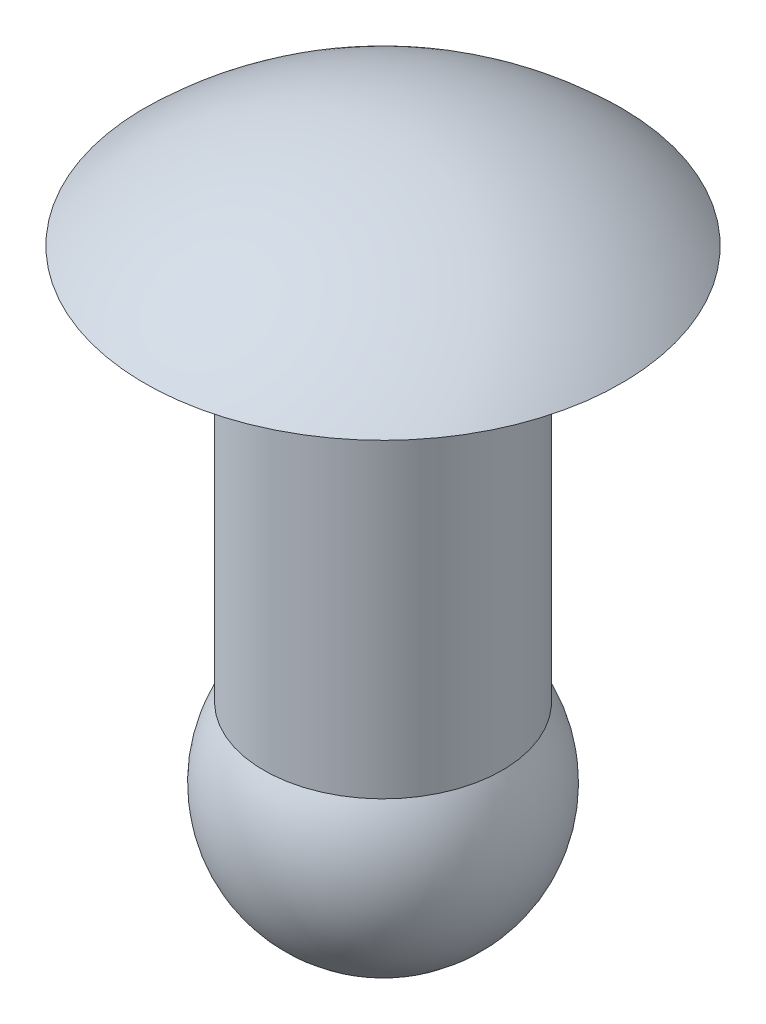
ISO-10303-21;
HEADER;
FILE_DESCRIPTION(('STEP AP214'),'2;1');
FILE_NAME('part.step','',(''),(''),'','','');
FILE_SCHEMA(('AUTOMOTIVE_DESIGN { 1 0 10303 214 1 1 1 1 }'));
ENDSEC;
DATA;
#1=APPLICATION_CONTEXT('core data for automotive mechanical design processes');
#2=APPLICATION_PROTOCOL_DEFINITION('international standard','automotive_design',2000,#1);
#3=PRODUCT_CONTEXT('',#1,'mechanical');
#4=PRODUCT('Part','Part','',(#3));
#5=PRODUCT_RELATED_PRODUCT_CATEGORY('part','',(#4));
#6=PRODUCT_DEFINITION_FORMATION('','',#4);
#7=PRODUCT_DEFINITION_CONTEXT('part definition',#1,'design');
#8=PRODUCT_DEFINITION('design','',#6,#7);
#9=PRODUCT_DEFINITION_SHAPE('','',#8);
#10=(LENGTH_UNIT() NAMED_UNIT(*) SI_UNIT(.MILLI.,.METRE.));
#11=(NAMED_UNIT(*) PLANE_ANGLE_UNIT() SI_UNIT($,.RADIAN.));
#12=(NAMED_UNIT(*) SI_UNIT($,.STERADIAN.) SOLID_ANGLE_UNIT());
#13=UNCERTAINTY_MEASURE_WITH_UNIT(LENGTH_MEASURE(1.E-05),#10,'distance_accuracy_value','');
#14=(GEOMETRIC_REPRESENTATION_CONTEXT(3) GLOBAL_UNCERTAINTY_ASSIGNED_CONTEXT((#13)) GLOBAL_UNIT_ASSIGNED_CONTEXT((#10,
#11,#12)) REPRESENTATION_CONTEXT('',''));
#15=CARTESIAN_POINT('',(0.,0.,0.));
#16=DIRECTION('',(0.,0.,1.));
#17=DIRECTION('',(1.,0.,0.));
#18=AXIS2_PLACEMENT_3D('',#15,#16,#17);
#19=CARTESIAN_POINT('',(-2.287559345,4.282481327,-3.224808209));
#20=CARTESIAN_POINT('',(-0.939210445,5.590311701,-3.224808209));
#21=CARTESIAN_POINT('',(0.939210445,5.590311701,-3.224808209));
#22=CARTESIAN_POINT('',(2.287559345,4.282481327,-3.224808209));
#23=CARTESIAN_POINT('',(-3.577324754,5.612205582,-1.337415887));
#24=CARTESIAN_POINT('',(-1.468753492,7.657413275,-1.337415887));
#25=CARTESIAN_POINT('',(1.468753492,7.657413275,-1.337415887));
#26=CARTESIAN_POINT('',(3.577324754,5.612205582,-1.337415887));
#27=CARTESIAN_POINT('',(-3.582739532,5.617788118,1.307173059));
#28=CARTESIAN_POINT('',(-1.470976654,7.666091517,1.307173059));
#29=CARTESIAN_POINT('',(1.470976654,7.666091517,1.307173059));
#30=CARTESIAN_POINT('',(3.582739532,5.617788118,1.307173059));
#31=CARTESIAN_POINT('',(-2.300725211,4.296055091,3.205428117));
#32=CARTESIAN_POINT('',(-0.944615996,5.611412579,3.205428117));
#33=CARTESIAN_POINT('',(0.944615996,5.611412579,3.205428117));
#34=CARTESIAN_POINT('',(2.300725211,4.296055091,3.205428117));
#35=(BOUNDED_SURFACE() B_SPLINE_SURFACE(3,3,((#19,#20,#21,#22),(#23,#24,#25,#26),(#27,#28,#29,
#30),(#31,#32,#33,#34)),.UNSPECIFIED.,.F.,.F.,.F.) B_SPLINE_SURFACE_WITH_KNOTS((4,4),(4,4),(0.,
1.),(0.,1.),.UNSPECIFIED.) GEOMETRIC_REPRESENTATION_ITEM() RATIONAL_B_SPLINE_SURFACE(((1.,
0.811873191342098,0.811873191342098,1.),(0.810489702651865,0.658014861441878,0.658014861441878,
0.810489702651865),(0.810489702651865,0.658014861441878,0.658014861441878,0.810489702651865),
(1.,0.811873191342098,0.811873191342098,1.))) REPRESENTATION_ITEM('') SURFACE());
#36=CARTESIAN_POINT('',(-0.00214546357053898,5.2578,-3.17499927531435));
#37=CARTESIAN_POINT('',(0.0869981318106553,5.25779999999999,-3.17505897671371));
#38=CARTESIAN_POINT('',(0.176160824831718,5.2578,-3.17136210516501));
#39=CARTESIAN_POINT('',(0.353875181150124,5.2578,-3.15647811406601));
#40=CARTESIAN_POINT('',(0.442426655132659,5.25779999999997,-3.14528877053104));
#41=CARTESIAN_POINT('',(0.618421742379908,5.25780000000003,-3.1154700243774));
#42=CARTESIAN_POINT('',(0.705863361613748,5.25780000000012,-3.09682877419323));
#43=CARTESIAN_POINT('',(0.87891395511816,5.25779999999988,-3.05223464101823));
#44=CARTESIAN_POINT('',(0.964521382204615,5.25779999999955,-3.02627582802814));
#45=CARTESIAN_POINT('',(1.21730845527841,5.25779999999936,-2.93778201803796));
#46=CARTESIAN_POINT('',(1.38087872991937,5.25780000000027,-2.86455702981357));
#47=CARTESIAN_POINT('',(1.69338603857841,5.25779999999973,-2.69164636275795));
#48=CARTESIAN_POINT('',(1.84232251412843,5.25779999999829,-2.59195967460875));
#49=CARTESIAN_POINT('',(2.05151590848809,5.25779999999902,-2.42485297100806));
#50=CARTESIAN_POINT('',(2.11891789582644,5.25779999999974,-2.36617716868031));
#51=CARTESIAN_POINT('',(2.24849285317392,5.25780000000026,-2.24340235479813));
#52=CARTESIAN_POINT('',(2.31067080219928,5.25780000000006,-2.17930862669997));
#53=CARTESIAN_POINT('',(2.42943346772015,5.25779999999994,-2.04608029286053));
#54=CARTESIAN_POINT('',(2.48601563586524,5.25780000000001,-1.97694341511677));
#55=CARTESIAN_POINT('',(2.59316027430321,5.25779999999999,-1.83415512605082));
#56=CARTESIAN_POINT('',(2.64372134729864,5.25779999999988,-1.76050267279657));
#57=CARTESIAN_POINT('',(2.78577490313648,5.25779999999976,-1.53357504088747));
#58=CARTESIAN_POINT('',(2.86776301680718,5.25779999999994,-1.37418877484607));
#59=CARTESIAN_POINT('',(3.00376694501873,5.25780000000006,-1.04399978690369));
#60=CARTESIAN_POINT('',(3.0577830600465,5.25780000000002,-0.873197187663992));
#61=CARTESIAN_POINT('',(3.13638777452094,5.25779999999998,-0.524925727716807));
#62=CARTESIAN_POINT('',(3.16097621614123,5.2578,-0.347456831261926));
#63=CARTESIAN_POINT('',(3.18000224271982,5.2578,0.00908987291733829));
#64=CARTESIAN_POINT('',(3.17443982719996,5.2578,0.188167680667238));
#65=CARTESIAN_POINT('',(3.13334484160771,5.25779999999999,0.542826563257487));
#66=CARTESIAN_POINT('',(3.09781243090279,5.2578,0.718407656686767));
#67=CARTESIAN_POINT('',(2.99771983748632,5.2578,1.06119521319704));
#68=CARTESIAN_POINT('',(2.93315934653223,5.25779999999999,1.22840158732785));
#69=CARTESIAN_POINT('',(2.81606233947507,5.2578,1.4691579617391));
#70=CARTESIAN_POINT('',(2.77362656664315,5.2578,1.54777288277449));
#71=CARTESIAN_POINT('',(2.68228607064945,5.2578,1.70115267885848));
#72=CARTESIAN_POINT('',(2.63338284766387,5.2578,1.77591844117938));
#73=CARTESIAN_POINT('',(2.52947289496928,5.2578,1.92102902733083));
#74=CARTESIAN_POINT('',(2.47446893680389,5.25780000000001,1.99137583611031));
#75=CARTESIAN_POINT('',(2.35869557969537,5.25779999999999,2.12724295933144));
#76=CARTESIAN_POINT('',(2.29792066798828,5.25779999999997,2.19275855040389));
#77=CARTESIAN_POINT('',(2.10769888214459,5.25780000000002,2.38117882822184));
#78=CARTESIAN_POINT('',(1.97021695261188,5.25780000000018,2.49614934735419));
#79=CARTESIAN_POINT('',(1.67788562572476,5.25779999999982,2.70133538794539));
#80=CARTESIAN_POINT('',(1.52303688657147,5.25779999999931,2.79155184713541));
#81=CARTESIAN_POINT('',(1.28110332454774,5.25779999999962,2.90644474704262));
#82=CARTESIAN_POINT('',(1.19874503505598,5.2577999999999,2.94136639884637));
#83=CARTESIAN_POINT('',(1.03142388650425,5.2578000000001,3.00412320223637));
#84=CARTESIAN_POINT('',(0.946463199433799,5.25780000000002,3.0319640921632));
#85=CARTESIAN_POINT('',(0.774641096034467,5.25779999999998,3.08034316463296));
#86=CARTESIAN_POINT('',(0.687782902928832,5.25780000000002,3.10089284247258));
#87=CARTESIAN_POINT('',(0.512660866337135,5.25779999999998,3.13460511288035));
#88=CARTESIAN_POINT('',(0.424397442898096,5.25779999999989,3.14776987182063));
#89=CARTESIAN_POINT('',(0.279999390631775,5.25779999999992,3.16312678749174));
#90=CARTESIAN_POINT('',(0.224095132271928,5.25779999999998,3.16757782271789));
#91=CARTESIAN_POINT('',(0.112129386246193,5.25780000000002,3.17351459615649));
#92=CARTESIAN_POINT('',(0.0560678985803034,5.25780000000001,3.17500033436893));
#93=CARTESIAN_POINT('',(-0.0891444712561206,5.2578,3.17499946751233));
#94=CARTESIAN_POINT('',(-0.17830514867692,5.25780000000001,3.17124228836202));
#95=CARTESIAN_POINT('',(-0.356010288426505,5.25779999999999,3.15623801645923));
#96=CARTESIAN_POINT('',(-0.444554562155077,5.25779999999997,3.14498872506225));
#97=CARTESIAN_POINT('',(-0.620529270615454,5.25780000000003,3.11505092546794));
#98=CARTESIAN_POINT('',(-0.707957715812474,5.25780000000012,3.09635064557723));
#99=CARTESIAN_POINT('',(-0.880977136657799,5.25779999999988,3.05163976180837));
#100=CARTESIAN_POINT('',(-0.966566559318639,5.25779999999956,3.02562322207972));
#101=CARTESIAN_POINT('',(-1.21929336829182,5.25779999999937,2.93695875947783));
#102=CARTESIAN_POINT('',(-1.3828141437273,5.25780000000026,2.86362324595098));
#103=CARTESIAN_POINT('',(-1.69520453394048,5.25779999999974,2.69050143882287));
#104=CARTESIAN_POINT('',(-1.84407359337172,5.25779999999831,2.59071414314432));
#105=CARTESIAN_POINT('',(-2.0531540233257,5.25779999999903,2.42346611543562));
#106=CARTESIAN_POINT('',(-2.12051636578868,5.25779999999974,2.36474476160321));
#107=CARTESIAN_POINT('',(-2.2500083694758,5.25780000000026,2.24188237348057));
#108=CARTESIAN_POINT('',(-2.3121430130618,5.25780000000006,2.1777466190439));
#109=CARTESIAN_POINT('',(-2.43081561844898,5.25779999999994,2.04443805495918));
#110=CARTESIAN_POINT('',(-2.48735103415319,5.25780000000001,1.9752629784043));
#111=CARTESIAN_POINT('',(-2.59439912166657,5.25779999999999,1.83240236430654));
#112=CARTESIAN_POINT('',(-2.64491039553935,5.25779999999988,1.75871578582438));
#113=CARTESIAN_POINT('',(-2.78681055398592,5.25779999999976,1.53169224961623));
#114=CARTESIAN_POINT('',(-2.86869094153323,5.25779999999994,1.37225062798893));
#115=CARTESIAN_POINT('',(-3.00447172137644,5.25780000000006,1.041969813987));
#116=CARTESIAN_POINT('',(-3.05837241078021,5.25780000000001,0.871130742660134));
#117=CARTESIAN_POINT('',(-3.13674177060501,5.25779999999998,0.522806232560756));
#118=CARTESIAN_POINT('',(-3.1612102845324,5.2578,0.345320758453867));
#119=CARTESIAN_POINT('',(-3.17999537415191,5.2578,-0.0112387209430414));
#120=CARTESIAN_POINT('',(-3.17431195032226,5.2578,-0.190312726207865));
#121=CARTESIAN_POINT('',(-3.13297731975246,5.25779999999999,-0.544943744605718));
#122=CARTESIAN_POINT('',(-3.09732627374531,5.2578,-0.720500776597057));
#123=CARTESIAN_POINT('',(-2.99700207267126,5.2578,-1.06322061964764));
#124=CARTESIAN_POINT('',(-2.93232860583105,5.2578,-1.23038334050955));
#125=CARTESIAN_POINT('',(-2.81506891971742,5.2578,-1.4710605699949));
#126=CARTESIAN_POINT('',(-2.77258001828287,5.2578,-1.54964682335761));
#127=CARTESIAN_POINT('',(-2.68113586443507,5.2578,-1.70296491011554));
#128=CARTESIAN_POINT('',(-2.63218211166762,5.2578,-1.77769763183781));
#129=CARTESIAN_POINT('',(-2.52817411954565,5.2578,-1.92273796137993));
#130=CARTESIAN_POINT('',(-2.47312265451445,5.2578,-1.99304755897746));
#131=CARTESIAN_POINT('',(-2.35725754798382,5.2578,-2.12883637126945));
#132=CARTESIAN_POINT('',(-2.29643839666632,5.25779999999998,-2.19431085865839));
#133=CARTESIAN_POINT('',(-2.10608933494405,5.25780000000003,-2.3826025506553));
#134=CARTESIAN_POINT('',(-1.96852972816642,5.25780000000018,-2.4974801555556));
#135=CARTESIAN_POINT('',(-1.67605981057728,5.25779999999982,-2.7024686039556));
#136=CARTESIAN_POINT('',(-1.52115016183669,5.2577999999993,-2.79258039205641));
#137=CARTESIAN_POINT('',(-1.2791386272968,5.25779999999961,-2.9073099690791));
#138=CARTESIAN_POINT('',(-1.19675632979641,5.2577999999999,-2.94217612177082));
#139=CARTESIAN_POINT('',(-1.02939183713403,5.2578000000001,-3.00482012567162));
#140=CARTESIAN_POINT('',(-0.944411807571999,5.25780000000002,-3.03260371001656));
#141=CARTESIAN_POINT('',(-0.772556849888601,5.25779999999998,-3.08086655162373));
#142=CARTESIAN_POINT('',(-0.68568515748475,5.25780000000002,-3.10135737915387));
#143=CARTESIAN_POINT('',(-0.510541236447147,5.25779999999998,-3.13495101782696));
#144=CARTESIAN_POINT('',(-0.422269431250705,5.2577999999999,-3.14805602046457));
#145=CARTESIAN_POINT('',(-0.278573098710594,5.25779999999993,-3.16324012185687));
#146=CARTESIAN_POINT('',(-0.223380989432991,5.25779999999998,-3.16761568933273));
#147=CARTESIAN_POINT('',(-0.11284352908733,5.25780000000002,-3.17347673060474));
#148=CARTESIAN_POINT('',(-0.0574981780192702,5.2578,-3.17496220440089));
#149=CARTESIAN_POINT('',(-0.00214546357053898,5.2578,-3.17499927531435));
#150=B_SPLINE_CURVE_WITH_KNOTS('',3,(#36,#37,#38,#39,#40,#41,#42,#43,#44,#45,#46,#47,#48,#49,
#50,#51,#52,#53,#54,#55,#56,#57,#58,#59,#60,#61,#62,#63,#64,#65,#66,#67,#68,#69,#70,#71,#72,#73,
#74,#75,#76,#77,#78,#79,#80,#81,#82,#83,#84,#85,#86,#87,#88,#89,#90,#91,#92,#93,#94,#95,#96,#97,
#98,#99,#100,#101,#102,#103,#104,#105,#106,#107,#108,#109,#110,#111,#112,#113,#114,#115,#116,
#117,#118,#119,#120,#121,#122,#123,#124,#125,#126,#127,#128,#129,#130,#131,#132,#133,#134,#135,
#136,#137,#138,#139,#140,#141,#142,#143,#144,#145,#146,#147,#148,#149),.UNSPECIFIED.,.T.,.F.,(4,
2,2,2,2,2,2,2,2,2,2,2,2,2,2,2,2,2,2,2,2,2,2,2,2,2,2,2,2,2,2,2,2,2,2,2,2,2,2,2,2,2,2,2,2,2,2,2,2,
2,2,2,2,2,2,2,4),(0.,0.267379866197166,0.534839133756329,0.802725328902032,1.07082924058483,
1.6057576369669,2.14070643983986,2.4085312742622,2.67609787932641,2.94378577999328,
3.21153568162507,3.74647715450799,4.2814128807064,4.81635147585711,5.35129007949147,
5.8862258385719,6.42116727814691,6.68891709026893,6.95660490428127,7.22417160290016,
7.49199651920609,8.02694525253116,8.56187371817594,8.82997625305759,9.09786081683937,
9.3653211382651,9.63270295889719,9.80087420483597,9.96904545077474,10.2364272713761,
10.503887592771,10.7717721565219,11.0398746913727,11.5748031571585,12.1097518906258,
12.3775768071231,12.645143505933,12.9128313201364,13.1805811324496,13.715522572271,
14.2504583315966,14.7853969352134,15.3203355303455,15.8552712563233,16.3902127289849,
16.6579626304473,16.9256505309448,17.1932171358397,17.4610419700923,17.9959907728082,
18.5309191690342,18.7990230807296,19.0669092758879,19.3343685434599,19.6017484096697,
19.767774934847,19.9338014600244),.UNSPECIFIED.);
#151=CARTESIAN_POINT('',(-0.00214546357053898,5.2578,-3.17499927531435));
#152=VERTEX_POINT('',#151);
#153=EDGE_CURVE('E19',#152,#152,#150,.T.);
#154=ORIENTED_EDGE('',*,*,#153,.F.);
#155=EDGE_LOOP('',(#154));
#156=FACE_BOUND('',#155,.T.);
#157=ADVANCED_FACE('F15',(#156),#35,.T.);
#158=CARTESIAN_POINT('',(-3.2131,5.2578,3.213218746));
#159=DIRECTION('',(0.,-1.,0.));
#160=DIRECTION('',(0.,0.,-1.));
#161=AXIS2_PLACEMENT_3D('',#158,#159,#160);
#162=PLANE('',#161);
#163=CARTESIAN_POINT('',(0.,5.2578,0.));
#164=DIRECTION('',(0.,-1.,0.));
#165=DIRECTION('',(0.,0.,-1.));
#166=AXIS2_PLACEMENT_3D('',#163,#164,#165);
#167=CIRCLE('',#166,1.5875);
#168=CARTESIAN_POINT('',(0.,5.2578,-1.5875));
#169=VERTEX_POINT('',#168);
#170=EDGE_CURVE('E26',#169,#169,#167,.F.);
#171=ORIENTED_EDGE('',*,*,#170,.T.);
#172=EDGE_LOOP('',(#171));
#173=FACE_BOUND('',#172,.T.);
#174=ORIENTED_EDGE('',*,*,#153,.T.);
#175=EDGE_LOOP('',(#174));
#176=FACE_BOUND('',#175,.T.);
#177=ADVANCED_FACE('F36',(#173,#176),#162,.T.);
#178=CARTESIAN_POINT('',(0.,5.2578,0.));
#179=DIRECTION('',(0.,-1.,0.));
#180=DIRECTION('',(0.,0.,-1.));
#181=AXIS2_PLACEMENT_3D('',#178,#179,#180);
#182=CYLINDRICAL_SURFACE('',#181,1.5875);
#183=CARTESIAN_POINT('',(0.,0.,0.));
#184=DIRECTION('',(0.,-1.,0.));
#185=DIRECTION('',(0.,0.,-1.));
#186=AXIS2_PLACEMENT_3D('',#183,#184,#185);
#187=CIRCLE('',#186,1.5875);
#188=CARTESIAN_POINT('',(0.,0.,-1.5875));
#189=VERTEX_POINT('',#188);
#190=EDGE_CURVE('E10',#189,#189,#187,.T.);
#191=ORIENTED_EDGE('',*,*,#190,.F.);
#192=EDGE_LOOP('',(#191));
#193=FACE_BOUND('',#192,.T.);
#194=ORIENTED_EDGE('',*,*,#170,.F.);
#195=EDGE_LOOP('',(#194));
#196=FACE_BOUND('',#195,.T.);
#197=ADVANCED_FACE('F43',(#193,#196),#182,.T.);
#198=CARTESIAN_POINT('',(0.,-0.933255592,0.));
#199=DIRECTION('',(0.,0.,1.));
#200=DIRECTION('',(1.,0.,0.));
#201=AXIS2_PLACEMENT_3D('',#198,#199,#200);
#202=SPHERICAL_SURFACE('',#201,1.8415);
#203=CARTESIAN_POINT('',(0.,-0.933255592,0.));
#204=DIRECTION('',(0.,-1.,0.));
#205=DIRECTION('',(0.,0.,-1.));
#206=AXIS2_PLACEMENT_3D('',#203,#204,#205);
#207=SPHERICAL_SURFACE('',#206,1.8415);
#208=ORIENTED_EDGE('',*,*,#190,.T.);
#209=EDGE_LOOP('',(#208));
#210=FACE_BOUND('',#209,.T.);
#211=ADVANCED_FACE('F17',(#210),#207,.T.);
#212=CLOSED_SHELL('',(#157,#177,#197,#211));
#213=MANIFOLD_SOLID_BREP('B1',#212);
#214=ADVANCED_BREP_SHAPE_REPRESENTATION('',(#18,#213),#14);
#215=SHAPE_DEFINITION_REPRESENTATION(#9,#214);
ENDSEC;
END-ISO-10303-21;
